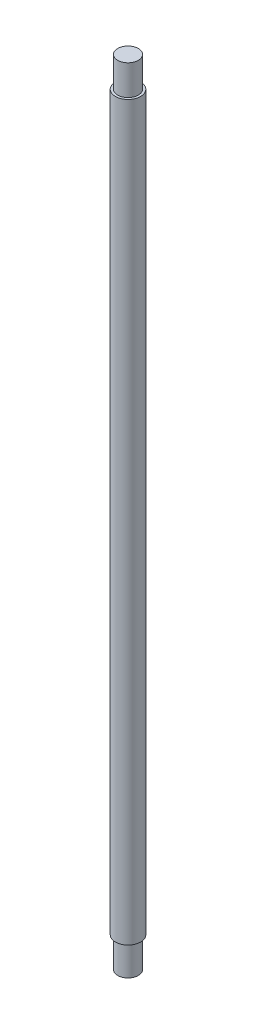
ISO-10303-21;
HEADER;
FILE_DESCRIPTION(('STEP AP214'),'2;1');
FILE_NAME('part.step','',(''),(''),'','','');
FILE_SCHEMA(('AUTOMOTIVE_DESIGN { 1 0 10303 214 1 1 1 1 }'));
ENDSEC;
DATA;
#1=APPLICATION_CONTEXT('core data for automotive mechanical design processes');
#2=APPLICATION_PROTOCOL_DEFINITION('international standard','automotive_design',2000,#1);
#3=PRODUCT_CONTEXT('',#1,'mechanical');
#4=PRODUCT('Part','Part','',(#3));
#5=PRODUCT_RELATED_PRODUCT_CATEGORY('part','',(#4));
#6=PRODUCT_DEFINITION_FORMATION('','',#4);
#7=PRODUCT_DEFINITION_CONTEXT('part definition',#1,'design');
#8=PRODUCT_DEFINITION('design','',#6,#7);
#9=PRODUCT_DEFINITION_SHAPE('','',#8);
#10=(LENGTH_UNIT() NAMED_UNIT(*) SI_UNIT(.MILLI.,.METRE.));
#11=(NAMED_UNIT(*) PLANE_ANGLE_UNIT() SI_UNIT($,.RADIAN.));
#12=(NAMED_UNIT(*) SI_UNIT($,.STERADIAN.) SOLID_ANGLE_UNIT());
#13=UNCERTAINTY_MEASURE_WITH_UNIT(LENGTH_MEASURE(1.E-05),#10,'distance_accuracy_value','');
#14=(GEOMETRIC_REPRESENTATION_CONTEXT(3) GLOBAL_UNCERTAINTY_ASSIGNED_CONTEXT((#13)) GLOBAL_UNIT_ASSIGNED_CONTEXT((#10,
#11,#12)) REPRESENTATION_CONTEXT('',''));
#15=CARTESIAN_POINT('',(0.,0.,0.));
#16=DIRECTION('',(0.,0.,1.));
#17=DIRECTION('',(1.,0.,0.));
#18=AXIS2_PLACEMENT_3D('',#15,#16,#17);
#19=CARTESIAN_POINT('',(0.,5195.,0.));
#20=DIRECTION('',(0.,-1.,0.));
#21=DIRECTION('',(0.,0.,-1.));
#22=AXIS2_PLACEMENT_3D('',#19,#20,#21);
#23=CYLINDRICAL_SURFACE('',#22,82.5);
#24=CARTESIAN_POINT('',(0.,197.5,0.));
#25=DIRECTION('',(0.,-1.,0.));
#26=DIRECTION('',(0.,0.,-1.));
#27=AXIS2_PLACEMENT_3D('',#24,#25,#26);
#28=CIRCLE('',#27,82.5);
#29=CARTESIAN_POINT('',(0.,197.5,-82.5));
#30=VERTEX_POINT('',#29);
#31=EDGE_CURVE('E10',#30,#30,#28,.T.);
#32=ORIENTED_EDGE('',*,*,#31,.F.);
#33=EDGE_LOOP('',(#32));
#34=FACE_BOUND('',#33,.T.);
#35=CARTESIAN_POINT('',(0.,4997.5,0.));
#36=DIRECTION('',(0.,1.,0.));
#37=DIRECTION('',(0.,0.,1.));
#38=AXIS2_PLACEMENT_3D('',#35,#36,#37);
#39=CIRCLE('',#38,82.5);
#40=CARTESIAN_POINT('',(0.,4997.5,82.5));
#41=VERTEX_POINT('',#40);
#42=EDGE_CURVE('E55',#41,#41,#39,.T.);
#43=ORIENTED_EDGE('',*,*,#42,.F.);
#44=EDGE_LOOP('',(#43));
#45=FACE_BOUND('',#44,.T.);
#46=ADVANCED_FACE('F37',(#34,#45),#23,.T.);
#47=CARTESIAN_POINT('',(0.,197.5,0.));
#48=DIRECTION('',(0.,-1.,0.));
#49=DIRECTION('',(0.,0.,-1.));
#50=AXIS2_PLACEMENT_3D('',#47,#48,#49);
#51=PLANE('',#50);
#52=CARTESIAN_POINT('',(0.,197.5,0.));
#53=DIRECTION('',(0.,-1.,0.));
#54=DIRECTION('',(0.,0.,-1.));
#55=AXIS2_PLACEMENT_3D('',#52,#53,#54);
#56=CIRCLE('',#55,67.5);
#57=CARTESIAN_POINT('',(0.,197.5,-67.5));
#58=VERTEX_POINT('',#57);
#59=EDGE_CURVE('E44',#58,#58,#56,.T.);
#60=ORIENTED_EDGE('',*,*,#59,.F.);
#61=EDGE_LOOP('',(#60));
#62=FACE_BOUND('',#61,.T.);
#63=ORIENTED_EDGE('',*,*,#31,.T.);
#64=EDGE_LOOP('',(#63));
#65=FACE_BOUND('',#64,.T.);
#66=ADVANCED_FACE('F80',(#62,#65),#51,.T.);
#67=CARTESIAN_POINT('',(0.,197.5,0.));
#68=DIRECTION('',(0.,-1.,0.));
#69=DIRECTION('',(0.,0.,-1.));
#70=AXIS2_PLACEMENT_3D('',#67,#68,#69);
#71=CYLINDRICAL_SURFACE('',#70,67.5);
#72=ORIENTED_EDGE('',*,*,#59,.T.);
#73=EDGE_LOOP('',(#72));
#74=FACE_BOUND('',#73,.T.);
#75=CARTESIAN_POINT('',(0.,0.,0.));
#76=DIRECTION('',(0.,-1.,0.));
#77=DIRECTION('',(0.,0.,-1.));
#78=AXIS2_PLACEMENT_3D('',#75,#76,#77);
#79=CIRCLE('',#78,67.5);
#80=CARTESIAN_POINT('',(0.,0.,-67.5));
#81=VERTEX_POINT('',#80);
#82=EDGE_CURVE('E49',#81,#81,#79,.T.);
#83=ORIENTED_EDGE('',*,*,#82,.F.);
#84=EDGE_LOOP('',(#83));
#85=FACE_BOUND('',#84,.T.);
#86=ADVANCED_FACE('F85',(#74,#85),#71,.T.);
#87=CARTESIAN_POINT('',(0.,0.,0.));
#88=DIRECTION('',(0.,1.,0.));
#89=DIRECTION('',(0.,0.,1.));
#90=AXIS2_PLACEMENT_3D('',#87,#88,#89);
#91=PLANE('',#90);
#92=ORIENTED_EDGE('',*,*,#82,.T.);
#93=EDGE_LOOP('',(#92));
#94=FACE_BOUND('',#93,.T.);
#95=ADVANCED_FACE('F75',(#94),#91,.F.);
#96=CARTESIAN_POINT('',(0.,4997.5,0.));
#97=DIRECTION('',(0.,1.,0.));
#98=DIRECTION('',(0.,0.,1.));
#99=AXIS2_PLACEMENT_3D('',#96,#97,#98);
#100=PLANE('',#99);
#101=CARTESIAN_POINT('',(0.,4997.5,0.));
#102=DIRECTION('',(0.,1.,0.));
#103=DIRECTION('',(0.,0.,1.));
#104=AXIS2_PLACEMENT_3D('',#101,#102,#103);
#105=CIRCLE('',#104,67.5);
#106=CARTESIAN_POINT('',(0.,4997.5,67.5));
#107=VERTEX_POINT('',#106);
#108=EDGE_CURVE('E60',#107,#107,#105,.T.);
#109=ORIENTED_EDGE('',*,*,#108,.F.);
#110=EDGE_LOOP('',(#109));
#111=FACE_BOUND('',#110,.T.);
#112=ORIENTED_EDGE('',*,*,#42,.T.);
#113=EDGE_LOOP('',(#112));
#114=FACE_BOUND('',#113,.T.);
#115=ADVANCED_FACE('F72',(#111,#114),#100,.T.);
#116=CARTESIAN_POINT('',(0.,4997.5,0.));
#117=DIRECTION('',(0.,1.,0.));
#118=DIRECTION('',(0.,0.,1.));
#119=AXIS2_PLACEMENT_3D('',#116,#117,#118);
#120=CYLINDRICAL_SURFACE('',#119,67.5);
#121=ORIENTED_EDGE('',*,*,#108,.T.);
#122=EDGE_LOOP('',(#121));
#123=FACE_BOUND('',#122,.T.);
#124=CARTESIAN_POINT('',(0.,5195.,0.));
#125=DIRECTION('',(0.,1.,0.));
#126=DIRECTION('',(0.,0.,1.));
#127=AXIS2_PLACEMENT_3D('',#124,#125,#126);
#128=CIRCLE('',#127,67.5);
#129=CARTESIAN_POINT('',(0.,5195.,67.5));
#130=VERTEX_POINT('',#129);
#131=EDGE_CURVE('E61',#130,#130,#128,.T.);
#132=ORIENTED_EDGE('',*,*,#131,.F.);
#133=EDGE_LOOP('',(#132));
#134=FACE_BOUND('',#133,.T.);
#135=ADVANCED_FACE('F69',(#123,#134),#120,.T.);
#136=CARTESIAN_POINT('',(0.,5195.,0.));
#137=DIRECTION('',(0.,1.,0.));
#138=DIRECTION('',(0.,0.,1.));
#139=AXIS2_PLACEMENT_3D('',#136,#137,#138);
#140=PLANE('',#139);
#141=ORIENTED_EDGE('',*,*,#131,.T.);
#142=EDGE_LOOP('',(#141));
#143=FACE_BOUND('',#142,.T.);
#144=ADVANCED_FACE('F93',(#143),#140,.T.);
#145=CLOSED_SHELL('',(#46,#66,#86,#95,#115,#135,#144));
#146=MANIFOLD_SOLID_BREP('B2',#145);
#147=ADVANCED_BREP_SHAPE_REPRESENTATION('',(#18,#146),#14);
#148=SHAPE_DEFINITION_REPRESENTATION(#9,#147);
ENDSEC;
END-ISO-10303-21;
